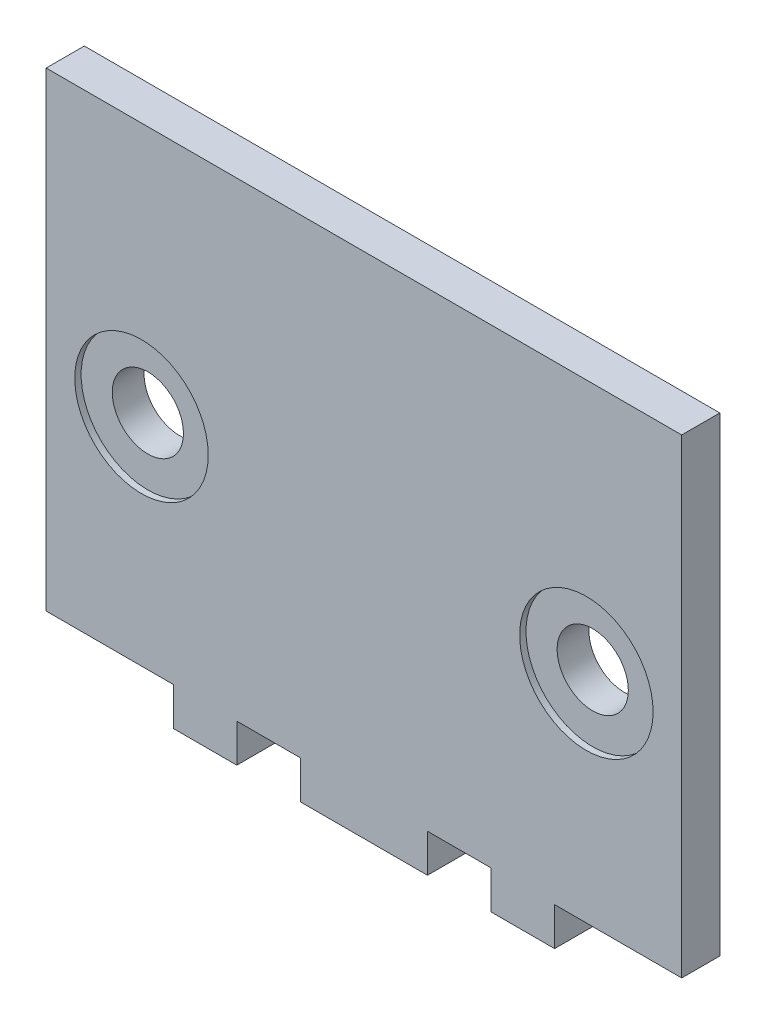
ISO-10303-21;
HEADER;
FILE_DESCRIPTION(('STEP AP214'),'2;1');
FILE_NAME('part.step','',(''),(''),'','','');
FILE_SCHEMA(('AUTOMOTIVE_DESIGN { 1 0 10303 214 1 1 1 1 }'));
ENDSEC;
DATA;
#1=APPLICATION_CONTEXT('core data for automotive mechanical design processes');
#2=APPLICATION_PROTOCOL_DEFINITION('international standard','automotive_design',2000,#1);
#3=PRODUCT_CONTEXT('',#1,'mechanical');
#4=PRODUCT('Part','Part','',(#3));
#5=PRODUCT_RELATED_PRODUCT_CATEGORY('part','',(#4));
#6=PRODUCT_DEFINITION_FORMATION('','',#4);
#7=PRODUCT_DEFINITION_CONTEXT('part definition',#1,'design');
#8=PRODUCT_DEFINITION('design','',#6,#7);
#9=PRODUCT_DEFINITION_SHAPE('','',#8);
#10=(LENGTH_UNIT() NAMED_UNIT(*) SI_UNIT(.MILLI.,.METRE.));
#11=(NAMED_UNIT(*) PLANE_ANGLE_UNIT() SI_UNIT($,.RADIAN.));
#12=(NAMED_UNIT(*) SI_UNIT($,.STERADIAN.) SOLID_ANGLE_UNIT());
#13=UNCERTAINTY_MEASURE_WITH_UNIT(LENGTH_MEASURE(1.E-05),#10,'distance_accuracy_value','');
#14=(GEOMETRIC_REPRESENTATION_CONTEXT(3) GLOBAL_UNCERTAINTY_ASSIGNED_CONTEXT((#13)) GLOBAL_UNIT_ASSIGNED_CONTEXT((#10,
#11,#12)) REPRESENTATION_CONTEXT('',''));
#15=CARTESIAN_POINT('',(0.,0.,0.));
#16=DIRECTION('',(0.,0.,1.));
#17=DIRECTION('',(1.,0.,0.));
#18=AXIS2_PLACEMENT_3D('',#15,#16,#17);
#19=CARTESIAN_POINT('',(0.,20.,3.));
#20=DIRECTION('',(0.,1.,0.));
#21=DIRECTION('',(-1.,0.,0.));
#22=AXIS2_PLACEMENT_3D('',#19,#20,#21);
#23=PLANE('',#22);
#24=DIRECTION('',(1.,0.,0.));
#25=VECTOR('',#24,1.);
#26=CARTESIAN_POINT('',(0.,20.,0.));
#27=LINE('',#26,#25);
#28=CARTESIAN_POINT('',(-25.,20.,0.));
#29=VERTEX_POINT('',#28);
#30=CARTESIAN_POINT('',(25.,20.,0.));
#31=VERTEX_POINT('',#30);
#32=EDGE_CURVE('E168',#29,#31,#27,.T.);
#33=ORIENTED_EDGE('',*,*,#32,.F.);
#34=DIRECTION('',(0.,0.,-1.));
#35=VECTOR('',#34,1.);
#36=CARTESIAN_POINT('',(-25.,20.,3.));
#37=LINE('',#36,#35);
#38=CARTESIAN_POINT('',(-25.,20.,3.));
#39=VERTEX_POINT('',#38);
#40=EDGE_CURVE('E163',#39,#29,#37,.T.);
#41=ORIENTED_EDGE('',*,*,#40,.F.);
#42=DIRECTION('',(1.,0.,0.));
#43=VECTOR('',#42,1.);
#44=CARTESIAN_POINT('',(0.,20.,3.));
#45=LINE('',#44,#43);
#46=CARTESIAN_POINT('',(25.,20.,3.));
#47=VERTEX_POINT('',#46);
#48=EDGE_CURVE('E166',#39,#47,#45,.T.);
#49=ORIENTED_EDGE('',*,*,#48,.T.);
#50=DIRECTION('',(0.,0.,-1.));
#51=VECTOR('',#50,1.);
#52=CARTESIAN_POINT('',(25.,20.,3.));
#53=LINE('',#52,#51);
#54=EDGE_CURVE('E251',#47,#31,#53,.T.);
#55=ORIENTED_EDGE('',*,*,#54,.T.);
#56=EDGE_LOOP('',(#33,#41,#49,#55));
#57=FACE_BOUND('',#56,.T.);
#58=ADVANCED_FACE('F52',(#57),#23,.T.);
#59=CARTESIAN_POINT('',(-25.,0.,3.));
#60=DIRECTION('',(1.,0.,0.));
#61=DIRECTION('',(0.,1.,0.));
#62=AXIS2_PLACEMENT_3D('',#59,#60,#61);
#63=PLANE('',#62);
#64=DIRECTION('',(0.,0.,-1.));
#65=VECTOR('',#64,1.);
#66=CARTESIAN_POINT('',(-25.,-17.,3.));
#67=LINE('',#66,#65);
#68=CARTESIAN_POINT('',(-25.,-17.,3.));
#69=VERTEX_POINT('',#68);
#70=CARTESIAN_POINT('',(-25.,-17.,0.));
#71=VERTEX_POINT('',#70);
#72=EDGE_CURVE('E60',#69,#71,#67,.T.);
#73=ORIENTED_EDGE('',*,*,#72,.F.);
#74=DIRECTION('',(0.,-1.,0.));
#75=VECTOR('',#74,1.);
#76=CARTESIAN_POINT('',(-25.,0.,3.));
#77=LINE('',#76,#75);
#78=EDGE_CURVE('E176',#39,#69,#77,.T.);
#79=ORIENTED_EDGE('',*,*,#78,.F.);
#80=ORIENTED_EDGE('',*,*,#40,.T.);
#81=DIRECTION('',(0.,-1.,0.));
#82=VECTOR('',#81,1.);
#83=CARTESIAN_POINT('',(-25.,0.,0.));
#84=LINE('',#83,#82);
#85=EDGE_CURVE('E254',#29,#71,#84,.T.);
#86=ORIENTED_EDGE('',*,*,#85,.T.);
#87=EDGE_LOOP('',(#73,#79,#80,#86));
#88=FACE_BOUND('',#87,.T.);
#89=ADVANCED_FACE('F177',(#88),#63,.F.);
#90=CARTESIAN_POINT('',(0.,-17.,3.));
#91=DIRECTION('',(0.,1.,0.));
#92=DIRECTION('',(0.,0.,1.));
#93=AXIS2_PLACEMENT_3D('',#90,#91,#92);
#94=PLANE('',#93);
#95=DIRECTION('',(1.,0.,0.));
#96=VECTOR('',#95,1.);
#97=CARTESIAN_POINT('',(0.,-17.,3.));
#98=LINE('',#97,#96);
#99=CARTESIAN_POINT('',(-15.,-17.,3.));
#100=VERTEX_POINT('',#99);
#101=EDGE_CURVE('E181',#69,#100,#98,.T.);
#102=ORIENTED_EDGE('',*,*,#101,.F.);
#103=ORIENTED_EDGE('',*,*,#72,.T.);
#104=DIRECTION('',(1.,0.,0.));
#105=VECTOR('',#104,1.);
#106=CARTESIAN_POINT('',(0.,-17.,0.));
#107=LINE('',#106,#105);
#108=CARTESIAN_POINT('',(-15.,-17.,0.));
#109=VERTEX_POINT('',#108);
#110=EDGE_CURVE('E258',#71,#109,#107,.T.);
#111=ORIENTED_EDGE('',*,*,#110,.T.);
#112=DIRECTION('',(0.,0.,-1.));
#113=VECTOR('',#112,1.);
#114=CARTESIAN_POINT('',(-15.,-17.,3.));
#115=LINE('',#114,#113);
#116=EDGE_CURVE('E173',#100,#109,#115,.T.);
#117=ORIENTED_EDGE('',*,*,#116,.F.);
#118=EDGE_LOOP('',(#102,#103,#111,#117));
#119=FACE_BOUND('',#118,.T.);
#120=ADVANCED_FACE('F350',(#119),#94,.F.);
#121=CARTESIAN_POINT('',(-15.,0.,3.));
#122=DIRECTION('',(1.,0.,0.));
#123=DIRECTION('',(0.,0.,-1.));
#124=AXIS2_PLACEMENT_3D('',#121,#122,#123);
#125=PLANE('',#124);
#126=DIRECTION('',(0.,-1.,0.));
#127=VECTOR('',#126,1.);
#128=CARTESIAN_POINT('',(-15.,0.,0.));
#129=LINE('',#128,#127);
#130=CARTESIAN_POINT('',(-15.,-20.,0.));
#131=VERTEX_POINT('',#130);
#132=EDGE_CURVE('E261',#109,#131,#129,.T.);
#133=ORIENTED_EDGE('',*,*,#132,.T.);
#134=DIRECTION('',(0.,0.,-1.));
#135=VECTOR('',#134,1.);
#136=CARTESIAN_POINT('',(-15.,-20.,3.));
#137=LINE('',#136,#135);
#138=CARTESIAN_POINT('',(-15.,-20.,3.));
#139=VERTEX_POINT('',#138);
#140=EDGE_CURVE('E339',#139,#131,#137,.T.);
#141=ORIENTED_EDGE('',*,*,#140,.F.);
#142=DIRECTION('',(0.,-1.,0.));
#143=VECTOR('',#142,1.);
#144=CARTESIAN_POINT('',(-15.,0.,3.));
#145=LINE('',#144,#143);
#146=EDGE_CURVE('E201',#100,#139,#145,.T.);
#147=ORIENTED_EDGE('',*,*,#146,.F.);
#148=ORIENTED_EDGE('',*,*,#116,.T.);
#149=EDGE_LOOP('',(#133,#141,#147,#148));
#150=FACE_BOUND('',#149,.T.);
#151=ADVANCED_FACE('F360',(#150),#125,.F.);
#152=CARTESIAN_POINT('',(0.,-20.,3.));
#153=DIRECTION('',(0.,1.,0.));
#154=DIRECTION('',(0.,0.,1.));
#155=AXIS2_PLACEMENT_3D('',#152,#153,#154);
#156=PLANE('',#155);
#157=DIRECTION('',(1.,0.,0.));
#158=VECTOR('',#157,1.);
#159=CARTESIAN_POINT('',(0.,-20.,0.));
#160=LINE('',#159,#158);
#161=CARTESIAN_POINT('',(-9.99999999999999,-20.,0.));
#162=VERTEX_POINT('',#161);
#163=EDGE_CURVE('E264',#131,#162,#160,.T.);
#164=ORIENTED_EDGE('',*,*,#163,.T.);
#165=DIRECTION('',(0.,0.,-1.));
#166=VECTOR('',#165,1.);
#167=CARTESIAN_POINT('',(-9.99999999999999,-20.,3.));
#168=LINE('',#167,#166);
#169=CARTESIAN_POINT('',(-9.99999999999999,-20.,3.));
#170=VERTEX_POINT('',#169);
#171=EDGE_CURVE('E336',#170,#162,#168,.T.);
#172=ORIENTED_EDGE('',*,*,#171,.F.);
#173=DIRECTION('',(1.,0.,0.));
#174=VECTOR('',#173,1.);
#175=CARTESIAN_POINT('',(0.,-20.,3.));
#176=LINE('',#175,#174);
#177=EDGE_CURVE('E204',#139,#170,#176,.T.);
#178=ORIENTED_EDGE('',*,*,#177,.F.);
#179=ORIENTED_EDGE('',*,*,#140,.T.);
#180=EDGE_LOOP('',(#164,#172,#178,#179));
#181=FACE_BOUND('',#180,.T.);
#182=ADVANCED_FACE('F364',(#181),#156,.F.);
#183=CARTESIAN_POINT('',(-10.,0.,3.));
#184=DIRECTION('',(1.,0.,0.));
#185=DIRECTION('',(0.,1.,0.));
#186=AXIS2_PLACEMENT_3D('',#183,#184,#185);
#187=PLANE('',#186);
#188=DIRECTION('',(0.,-1.,0.));
#189=VECTOR('',#188,1.);
#190=CARTESIAN_POINT('',(-10.,0.,0.));
#191=LINE('',#190,#189);
#192=CARTESIAN_POINT('',(-9.99999999999999,-17.,0.));
#193=VERTEX_POINT('',#192);
#194=EDGE_CURVE('E268',#193,#162,#191,.T.);
#195=ORIENTED_EDGE('',*,*,#194,.F.);
#196=DIRECTION('',(0.,0.,-1.));
#197=VECTOR('',#196,1.);
#198=CARTESIAN_POINT('',(-9.99999999999999,-17.,3.));
#199=LINE('',#198,#197);
#200=CARTESIAN_POINT('',(-9.99999999999999,-17.,3.));
#201=VERTEX_POINT('',#200);
#202=EDGE_CURVE('E333',#201,#193,#199,.T.);
#203=ORIENTED_EDGE('',*,*,#202,.F.);
#204=DIRECTION('',(0.,-1.,0.));
#205=VECTOR('',#204,1.);
#206=CARTESIAN_POINT('',(-10.,0.,3.));
#207=LINE('',#206,#205);
#208=EDGE_CURVE('E207',#201,#170,#207,.T.);
#209=ORIENTED_EDGE('',*,*,#208,.T.);
#210=ORIENTED_EDGE('',*,*,#171,.T.);
#211=EDGE_LOOP('',(#195,#203,#209,#210));
#212=FACE_BOUND('',#211,.T.);
#213=ADVANCED_FACE('F371',(#212),#187,.T.);
#214=CARTESIAN_POINT('',(0.,-17.,3.));
#215=DIRECTION('',(0.,1.,0.));
#216=DIRECTION('',(-1.,0.,0.));
#217=AXIS2_PLACEMENT_3D('',#214,#215,#216);
#218=PLANE('',#217);
#219=DIRECTION('',(1.,0.,0.));
#220=VECTOR('',#219,1.);
#221=CARTESIAN_POINT('',(0.,-17.,0.));
#222=LINE('',#221,#220);
#223=CARTESIAN_POINT('',(-4.99999999999999,-17.,0.));
#224=VERTEX_POINT('',#223);
#225=EDGE_CURVE('E272',#193,#224,#222,.T.);
#226=ORIENTED_EDGE('',*,*,#225,.T.);
#227=DIRECTION('',(0.,0.,-1.));
#228=VECTOR('',#227,1.);
#229=CARTESIAN_POINT('',(-4.99999999999999,-17.,3.));
#230=LINE('',#229,#228);
#231=CARTESIAN_POINT('',(-4.99999999999999,-17.,3.));
#232=VERTEX_POINT('',#231);
#233=EDGE_CURVE('E329',#232,#224,#230,.T.);
#234=ORIENTED_EDGE('',*,*,#233,.F.);
#235=DIRECTION('',(1.,0.,0.));
#236=VECTOR('',#235,1.);
#237=CARTESIAN_POINT('',(0.,-17.,3.));
#238=LINE('',#237,#236);
#239=EDGE_CURVE('E211',#201,#232,#238,.T.);
#240=ORIENTED_EDGE('',*,*,#239,.F.);
#241=ORIENTED_EDGE('',*,*,#202,.T.);
#242=EDGE_LOOP('',(#226,#234,#240,#241));
#243=FACE_BOUND('',#242,.T.);
#244=ADVANCED_FACE('F374',(#243),#218,.F.);
#245=CARTESIAN_POINT('',(-5.,0.,3.));
#246=DIRECTION('',(1.,0.,0.));
#247=DIRECTION('',(0.,1.,0.));
#248=AXIS2_PLACEMENT_3D('',#245,#246,#247);
#249=PLANE('',#248);
#250=DIRECTION('',(0.,-1.,0.));
#251=VECTOR('',#250,1.);
#252=CARTESIAN_POINT('',(-5.,0.,0.));
#253=LINE('',#252,#251);
#254=CARTESIAN_POINT('',(-4.99999999999999,-20.,0.));
#255=VERTEX_POINT('',#254);
#256=EDGE_CURVE('E275',#224,#255,#253,.T.);
#257=ORIENTED_EDGE('',*,*,#256,.T.);
#258=DIRECTION('',(0.,0.,-1.));
#259=VECTOR('',#258,1.);
#260=CARTESIAN_POINT('',(-4.99999999999999,-20.,3.));
#261=LINE('',#260,#259);
#262=CARTESIAN_POINT('',(-4.99999999999999,-20.,3.));
#263=VERTEX_POINT('',#262);
#264=EDGE_CURVE('E325',#263,#255,#261,.T.);
#265=ORIENTED_EDGE('',*,*,#264,.F.);
#266=DIRECTION('',(0.,-1.,0.));
#267=VECTOR('',#266,1.);
#268=CARTESIAN_POINT('',(-5.,0.,3.));
#269=LINE('',#268,#267);
#270=EDGE_CURVE('E214',#232,#263,#269,.T.);
#271=ORIENTED_EDGE('',*,*,#270,.F.);
#272=ORIENTED_EDGE('',*,*,#233,.T.);
#273=EDGE_LOOP('',(#257,#265,#271,#272));
#274=FACE_BOUND('',#273,.T.);
#275=ADVANCED_FACE('F379',(#274),#249,.F.);
#276=CARTESIAN_POINT('',(0.,-20.,3.));
#277=DIRECTION('',(0.,1.,0.));
#278=DIRECTION('',(0.,0.,1.));
#279=AXIS2_PLACEMENT_3D('',#276,#277,#278);
#280=PLANE('',#279);
#281=DIRECTION('',(1.,0.,0.));
#282=VECTOR('',#281,1.);
#283=CARTESIAN_POINT('',(0.,-20.,0.));
#284=LINE('',#283,#282);
#285=CARTESIAN_POINT('',(5.00000000000001,-20.,0.));
#286=VERTEX_POINT('',#285);
#287=EDGE_CURVE('E278',#255,#286,#284,.T.);
#288=ORIENTED_EDGE('',*,*,#287,.T.);
#289=DIRECTION('',(0.,0.,-1.));
#290=VECTOR('',#289,1.);
#291=CARTESIAN_POINT('',(5.00000000000001,-20.,3.));
#292=LINE('',#291,#290);
#293=CARTESIAN_POINT('',(5.00000000000001,-20.,3.));
#294=VERTEX_POINT('',#293);
#295=EDGE_CURVE('E322',#294,#286,#292,.T.);
#296=ORIENTED_EDGE('',*,*,#295,.F.);
#297=DIRECTION('',(1.,0.,0.));
#298=VECTOR('',#297,1.);
#299=CARTESIAN_POINT('',(0.,-20.,3.));
#300=LINE('',#299,#298);
#301=EDGE_CURVE('E217',#263,#294,#300,.T.);
#302=ORIENTED_EDGE('',*,*,#301,.F.);
#303=ORIENTED_EDGE('',*,*,#264,.T.);
#304=EDGE_LOOP('',(#288,#296,#302,#303));
#305=FACE_BOUND('',#304,.T.);
#306=ADVANCED_FACE('F385',(#305),#280,.F.);
#307=CARTESIAN_POINT('',(5.00000000000001,0.,3.));
#308=DIRECTION('',(1.,0.,0.));
#309=DIRECTION('',(0.,1.,0.));
#310=AXIS2_PLACEMENT_3D('',#307,#308,#309);
#311=PLANE('',#310);
#312=DIRECTION('',(0.,-1.,0.));
#313=VECTOR('',#312,1.);
#314=CARTESIAN_POINT('',(5.00000000000001,0.,0.));
#315=LINE('',#314,#313);
#316=CARTESIAN_POINT('',(5.00000000000001,-17.,0.));
#317=VERTEX_POINT('',#316);
#318=EDGE_CURVE('E282',#317,#286,#315,.T.);
#319=ORIENTED_EDGE('',*,*,#318,.F.);
#320=DIRECTION('',(0.,0.,-1.));
#321=VECTOR('',#320,1.);
#322=CARTESIAN_POINT('',(5.00000000000001,-17.,3.));
#323=LINE('',#322,#321);
#324=CARTESIAN_POINT('',(5.00000000000001,-17.,3.));
#325=VERTEX_POINT('',#324);
#326=EDGE_CURVE('E319',#325,#317,#323,.T.);
#327=ORIENTED_EDGE('',*,*,#326,.F.);
#328=DIRECTION('',(0.,-1.,0.));
#329=VECTOR('',#328,1.);
#330=CARTESIAN_POINT('',(5.00000000000001,0.,3.));
#331=LINE('',#330,#329);
#332=EDGE_CURVE('E220',#325,#294,#331,.T.);
#333=ORIENTED_EDGE('',*,*,#332,.T.);
#334=ORIENTED_EDGE('',*,*,#295,.T.);
#335=EDGE_LOOP('',(#319,#327,#333,#334));
#336=FACE_BOUND('',#335,.T.);
#337=ADVANCED_FACE('F389',(#336),#311,.T.);
#338=CARTESIAN_POINT('',(0.,-17.,3.));
#339=DIRECTION('',(0.,-1.,0.));
#340=DIRECTION('',(0.,0.,-1.));
#341=AXIS2_PLACEMENT_3D('',#338,#339,#340);
#342=PLANE('',#341);
#343=DIRECTION('',(-1.,0.,0.));
#344=VECTOR('',#343,1.);
#345=CARTESIAN_POINT('',(0.,-17.,0.));
#346=LINE('',#345,#344);
#347=CARTESIAN_POINT('',(10.,-17.,0.));
#348=VERTEX_POINT('',#347);
#349=EDGE_CURVE('E286',#348,#317,#346,.T.);
#350=ORIENTED_EDGE('',*,*,#349,.F.);
#351=DIRECTION('',(0.,0.,-1.));
#352=VECTOR('',#351,1.);
#353=CARTESIAN_POINT('',(10.,-17.,3.));
#354=LINE('',#353,#352);
#355=CARTESIAN_POINT('',(10.,-17.,3.));
#356=VERTEX_POINT('',#355);
#357=EDGE_CURVE('E316',#356,#348,#354,.T.);
#358=ORIENTED_EDGE('',*,*,#357,.F.);
#359=DIRECTION('',(-1.,0.,0.));
#360=VECTOR('',#359,1.);
#361=CARTESIAN_POINT('',(0.,-17.,3.));
#362=LINE('',#361,#360);
#363=EDGE_CURVE('E224',#356,#325,#362,.T.);
#364=ORIENTED_EDGE('',*,*,#363,.T.);
#365=ORIENTED_EDGE('',*,*,#326,.T.);
#366=EDGE_LOOP('',(#350,#358,#364,#365));
#367=FACE_BOUND('',#366,.T.);
#368=ADVANCED_FACE('F392',(#367),#342,.T.);
#369=CARTESIAN_POINT('',(10.,0.,3.));
#370=DIRECTION('',(1.,0.,0.));
#371=DIRECTION('',(0.,1.,0.));
#372=AXIS2_PLACEMENT_3D('',#369,#370,#371);
#373=PLANE('',#372);
#374=DIRECTION('',(0.,-1.,0.));
#375=VECTOR('',#374,1.);
#376=CARTESIAN_POINT('',(10.,0.,0.));
#377=LINE('',#376,#375);
#378=CARTESIAN_POINT('',(10.,-20.,0.));
#379=VERTEX_POINT('',#378);
#380=EDGE_CURVE('E290',#348,#379,#377,.T.);
#381=ORIENTED_EDGE('',*,*,#380,.T.);
#382=DIRECTION('',(0.,0.,-1.));
#383=VECTOR('',#382,1.);
#384=CARTESIAN_POINT('',(10.,-20.,3.));
#385=LINE('',#384,#383);
#386=CARTESIAN_POINT('',(10.,-20.,3.));
#387=VERTEX_POINT('',#386);
#388=EDGE_CURVE('E312',#387,#379,#385,.T.);
#389=ORIENTED_EDGE('',*,*,#388,.F.);
#390=DIRECTION('',(0.,-1.,0.));
#391=VECTOR('',#390,1.);
#392=CARTESIAN_POINT('',(10.,0.,3.));
#393=LINE('',#392,#391);
#394=EDGE_CURVE('E228',#356,#387,#393,.T.);
#395=ORIENTED_EDGE('',*,*,#394,.F.);
#396=ORIENTED_EDGE('',*,*,#357,.T.);
#397=EDGE_LOOP('',(#381,#389,#395,#396));
#398=FACE_BOUND('',#397,.T.);
#399=ADVANCED_FACE('F399',(#398),#373,.F.);
#400=CARTESIAN_POINT('',(0.,-20.,3.));
#401=DIRECTION('',(0.,1.,0.));
#402=DIRECTION('',(0.,0.,1.));
#403=AXIS2_PLACEMENT_3D('',#400,#401,#402);
#404=PLANE('',#403);
#405=DIRECTION('',(1.,0.,0.));
#406=VECTOR('',#405,1.);
#407=CARTESIAN_POINT('',(0.,-20.,0.));
#408=LINE('',#407,#406);
#409=CARTESIAN_POINT('',(15.,-20.,0.));
#410=VERTEX_POINT('',#409);
#411=EDGE_CURVE('E293',#379,#410,#408,.T.);
#412=ORIENTED_EDGE('',*,*,#411,.T.);
#413=DIRECTION('',(0.,0.,-1.));
#414=VECTOR('',#413,1.);
#415=CARTESIAN_POINT('',(15.,-20.,3.));
#416=LINE('',#415,#414);
#417=CARTESIAN_POINT('',(15.,-20.,3.));
#418=VERTEX_POINT('',#417);
#419=EDGE_CURVE('E309',#418,#410,#416,.T.);
#420=ORIENTED_EDGE('',*,*,#419,.F.);
#421=DIRECTION('',(1.,0.,0.));
#422=VECTOR('',#421,1.);
#423=CARTESIAN_POINT('',(0.,-20.,3.));
#424=LINE('',#423,#422);
#425=EDGE_CURVE('E231',#387,#418,#424,.T.);
#426=ORIENTED_EDGE('',*,*,#425,.F.);
#427=ORIENTED_EDGE('',*,*,#388,.T.);
#428=EDGE_LOOP('',(#412,#420,#426,#427));
#429=FACE_BOUND('',#428,.T.);
#430=ADVANCED_FACE('F403',(#429),#404,.F.);
#431=CARTESIAN_POINT('',(15.,0.,3.));
#432=DIRECTION('',(1.,0.,0.));
#433=DIRECTION('',(0.,0.,-1.));
#434=AXIS2_PLACEMENT_3D('',#431,#432,#433);
#435=PLANE('',#434);
#436=DIRECTION('',(0.,-1.,0.));
#437=VECTOR('',#436,1.);
#438=CARTESIAN_POINT('',(15.,0.,0.));
#439=LINE('',#438,#437);
#440=CARTESIAN_POINT('',(15.,-17.,0.));
#441=VERTEX_POINT('',#440);
#442=EDGE_CURVE('E297',#441,#410,#439,.T.);
#443=ORIENTED_EDGE('',*,*,#442,.F.);
#444=DIRECTION('',(0.,0.,-1.));
#445=VECTOR('',#444,1.);
#446=CARTESIAN_POINT('',(15.,-17.,3.));
#447=LINE('',#446,#445);
#448=CARTESIAN_POINT('',(15.,-17.,3.));
#449=VERTEX_POINT('',#448);
#450=EDGE_CURVE('E305',#449,#441,#447,.T.);
#451=ORIENTED_EDGE('',*,*,#450,.F.);
#452=DIRECTION('',(0.,-1.,0.));
#453=VECTOR('',#452,1.);
#454=CARTESIAN_POINT('',(15.,0.,3.));
#455=LINE('',#454,#453);
#456=EDGE_CURVE('E234',#449,#418,#455,.T.);
#457=ORIENTED_EDGE('',*,*,#456,.T.);
#458=ORIENTED_EDGE('',*,*,#419,.T.);
#459=EDGE_LOOP('',(#443,#451,#457,#458));
#460=FACE_BOUND('',#459,.T.);
#461=ADVANCED_FACE('F406',(#460),#435,.T.);
#462=CARTESIAN_POINT('',(0.,-17.,3.));
#463=DIRECTION('',(0.,-1.,0.));
#464=DIRECTION('',(0.,0.,-1.));
#465=AXIS2_PLACEMENT_3D('',#462,#463,#464);
#466=PLANE('',#465);
#467=DIRECTION('',(0.,0.,-1.));
#468=VECTOR('',#467,1.);
#469=CARTESIAN_POINT('',(25.,-17.,3.));
#470=LINE('',#469,#468);
#471=CARTESIAN_POINT('',(25.,-17.,3.));
#472=VERTEX_POINT('',#471);
#473=CARTESIAN_POINT('',(25.,-17.,0.));
#474=VERTEX_POINT('',#473);
#475=EDGE_CURVE('E12',#472,#474,#470,.T.);
#476=ORIENTED_EDGE('',*,*,#475,.F.);
#477=DIRECTION('',(-1.,0.,0.));
#478=VECTOR('',#477,1.);
#479=CARTESIAN_POINT('',(0.,-17.,3.));
#480=LINE('',#479,#478);
#481=EDGE_CURVE('E238',#472,#449,#480,.T.);
#482=ORIENTED_EDGE('',*,*,#481,.T.);
#483=ORIENTED_EDGE('',*,*,#450,.T.);
#484=DIRECTION('',(-1.,0.,0.));
#485=VECTOR('',#484,1.);
#486=CARTESIAN_POINT('',(0.,-17.,0.));
#487=LINE('',#486,#485);
#488=EDGE_CURVE('E193',#474,#441,#487,.T.);
#489=ORIENTED_EDGE('',*,*,#488,.F.);
#490=EDGE_LOOP('',(#476,#482,#483,#489));
#491=FACE_BOUND('',#490,.T.);
#492=ADVANCED_FACE('F407',(#491),#466,.T.);
#493=CARTESIAN_POINT('',(-17.5,0.,3.));
#494=DIRECTION('',(0.,0.,-1.));
#495=DIRECTION('',(-1.,0.,0.));
#496=AXIS2_PLACEMENT_3D('',#493,#494,#495);
#497=CYLINDRICAL_SURFACE('',#496,5.25);
#498=CARTESIAN_POINT('',(-17.5,0.,2.5));
#499=DIRECTION('',(0.,0.,1.));
#500=DIRECTION('',(1.,0.,0.));
#501=AXIS2_PLACEMENT_3D('',#498,#499,#500);
#502=CIRCLE('',#501,5.25);
#503=CARTESIAN_POINT('',(-12.25,0.,2.5));
#504=VERTEX_POINT('',#503);
#505=EDGE_CURVE('E172',#504,#504,#502,.T.);
#506=ORIENTED_EDGE('',*,*,#505,.F.);
#507=EDGE_LOOP('',(#506));
#508=FACE_BOUND('',#507,.T.);
#509=CARTESIAN_POINT('',(-17.5,0.,3.));
#510=DIRECTION('',(0.,0.,1.));
#511=DIRECTION('',(1.,0.,0.));
#512=AXIS2_PLACEMENT_3D('',#509,#510,#511);
#513=CIRCLE('',#512,5.25);
#514=CARTESIAN_POINT('',(-12.25,0.,3.));
#515=VERTEX_POINT('',#514);
#516=EDGE_CURVE('E243',#515,#515,#513,.T.);
#517=ORIENTED_EDGE('',*,*,#516,.T.);
#518=EDGE_LOOP('',(#517));
#519=FACE_BOUND('',#518,.T.);
#520=ADVANCED_FACE('F411',(#508,#519),#497,.F.);
#521=CARTESIAN_POINT('',(25.,0.,3.));
#522=DIRECTION('',(1.,0.,0.));
#523=DIRECTION('',(0.,0.,-1.));
#524=AXIS2_PLACEMENT_3D('',#521,#522,#523);
#525=PLANE('',#524);
#526=DIRECTION('',(0.,-1.,0.));
#527=VECTOR('',#526,1.);
#528=CARTESIAN_POINT('',(25.,0.,3.));
#529=LINE('',#528,#527);
#530=EDGE_CURVE('E186',#47,#472,#529,.T.);
#531=ORIENTED_EDGE('',*,*,#530,.T.);
#532=ORIENTED_EDGE('',*,*,#475,.T.);
#533=DIRECTION('',(0.,-1.,0.));
#534=VECTOR('',#533,1.);
#535=CARTESIAN_POINT('',(25.,0.,0.));
#536=LINE('',#535,#534);
#537=EDGE_CURVE('E189',#31,#474,#536,.T.);
#538=ORIENTED_EDGE('',*,*,#537,.F.);
#539=ORIENTED_EDGE('',*,*,#54,.F.);
#540=EDGE_LOOP('',(#531,#532,#538,#539));
#541=FACE_BOUND('',#540,.T.);
#542=ADVANCED_FACE('F408',(#541),#525,.T.);
#543=CARTESIAN_POINT('',(17.5,0.,3.));
#544=DIRECTION('',(0.,0.,-1.));
#545=DIRECTION('',(-1.,0.,0.));
#546=AXIS2_PLACEMENT_3D('',#543,#544,#545);
#547=CYLINDRICAL_SURFACE('',#546,5.25);
#548=CARTESIAN_POINT('',(17.5,0.,2.5));
#549=DIRECTION('',(0.,0.,1.));
#550=DIRECTION('',(1.,0.,0.));
#551=AXIS2_PLACEMENT_3D('',#548,#549,#550);
#552=CIRCLE('',#551,5.25);
#553=CARTESIAN_POINT('',(22.75,0.,2.5));
#554=VERTEX_POINT('',#553);
#555=EDGE_CURVE('E639',#554,#554,#552,.F.);
#556=ORIENTED_EDGE('',*,*,#555,.T.);
#557=EDGE_LOOP('',(#556));
#558=FACE_BOUND('',#557,.T.);
#559=CARTESIAN_POINT('',(17.5,0.,3.));
#560=DIRECTION('',(0.,0.,1.));
#561=DIRECTION('',(1.,0.,0.));
#562=AXIS2_PLACEMENT_3D('',#559,#560,#561);
#563=CIRCLE('',#562,5.25);
#564=CARTESIAN_POINT('',(22.75,0.,3.));
#565=VERTEX_POINT('',#564);
#566=EDGE_CURVE('E247',#565,#565,#563,.F.);
#567=ORIENTED_EDGE('',*,*,#566,.F.);
#568=EDGE_LOOP('',(#567));
#569=FACE_BOUND('',#568,.T.);
#570=ADVANCED_FACE('F410',(#558,#569),#547,.F.);
#571=CARTESIAN_POINT('',(0.,0.,3.));
#572=DIRECTION('',(0.,0.,1.));
#573=DIRECTION('',(1.,0.,0.));
#574=AXIS2_PLACEMENT_3D('',#571,#572,#573);
#575=PLANE('',#574);
#576=ORIENTED_EDGE('',*,*,#48,.F.);
#577=ORIENTED_EDGE('',*,*,#78,.T.);
#578=ORIENTED_EDGE('',*,*,#101,.T.);
#579=ORIENTED_EDGE('',*,*,#146,.T.);
#580=ORIENTED_EDGE('',*,*,#177,.T.);
#581=ORIENTED_EDGE('',*,*,#208,.F.);
#582=ORIENTED_EDGE('',*,*,#239,.T.);
#583=ORIENTED_EDGE('',*,*,#270,.T.);
#584=ORIENTED_EDGE('',*,*,#301,.T.);
#585=ORIENTED_EDGE('',*,*,#332,.F.);
#586=ORIENTED_EDGE('',*,*,#363,.F.);
#587=ORIENTED_EDGE('',*,*,#394,.T.);
#588=ORIENTED_EDGE('',*,*,#425,.T.);
#589=ORIENTED_EDGE('',*,*,#456,.F.);
#590=ORIENTED_EDGE('',*,*,#481,.F.);
#591=ORIENTED_EDGE('',*,*,#530,.F.);
#592=EDGE_LOOP('',(#576,#577,#578,#579,#580,#581,#582,#583,#584,#585,#586,#587,#588,#589,#590,#591));
#593=FACE_BOUND('',#592,.T.);
#594=ORIENTED_EDGE('',*,*,#516,.F.);
#595=EDGE_LOOP('',(#594));
#596=FACE_BOUND('',#595,.T.);
#597=ORIENTED_EDGE('',*,*,#566,.T.);
#598=EDGE_LOOP('',(#597));
#599=FACE_BOUND('',#598,.T.);
#600=ADVANCED_FACE('F183',(#593,#596,#599),#575,.T.);
#601=CARTESIAN_POINT('',(0.,0.,0.));
#602=DIRECTION('',(0.,0.,1.));
#603=DIRECTION('',(1.,0.,0.));
#604=AXIS2_PLACEMENT_3D('',#601,#602,#603);
#605=PLANE('',#604);
#606=ORIENTED_EDGE('',*,*,#32,.T.);
#607=ORIENTED_EDGE('',*,*,#537,.T.);
#608=ORIENTED_EDGE('',*,*,#488,.T.);
#609=ORIENTED_EDGE('',*,*,#442,.T.);
#610=ORIENTED_EDGE('',*,*,#411,.F.);
#611=ORIENTED_EDGE('',*,*,#380,.F.);
#612=ORIENTED_EDGE('',*,*,#349,.T.);
#613=ORIENTED_EDGE('',*,*,#318,.T.);
#614=ORIENTED_EDGE('',*,*,#287,.F.);
#615=ORIENTED_EDGE('',*,*,#256,.F.);
#616=ORIENTED_EDGE('',*,*,#225,.F.);
#617=ORIENTED_EDGE('',*,*,#194,.T.);
#618=ORIENTED_EDGE('',*,*,#163,.F.);
#619=ORIENTED_EDGE('',*,*,#132,.F.);
#620=ORIENTED_EDGE('',*,*,#110,.F.);
#621=ORIENTED_EDGE('',*,*,#85,.F.);
#622=EDGE_LOOP('',(#606,#607,#608,#609,#610,#611,#612,#613,#614,#615,#616,#617,#618,#619,#620,#621));
#623=FACE_BOUND('',#622,.T.);
#624=CARTESIAN_POINT('',(17.5,0.,0.));
#625=DIRECTION('',(0.,0.,1.));
#626=DIRECTION('',(1.,0.,0.));
#627=AXIS2_PLACEMENT_3D('',#624,#625,#626);
#628=CIRCLE('',#627,2.8);
#629=CARTESIAN_POINT('',(20.3,0.,0.));
#630=VERTEX_POINT('',#629);
#631=EDGE_CURVE('E634',#630,#630,#628,.F.);
#632=ORIENTED_EDGE('',*,*,#631,.F.);
#633=EDGE_LOOP('',(#632));
#634=FACE_BOUND('',#633,.T.);
#635=CARTESIAN_POINT('',(-17.5,0.,0.));
#636=DIRECTION('',(0.,0.,1.));
#637=DIRECTION('',(1.,0.,0.));
#638=AXIS2_PLACEMENT_3D('',#635,#636,#637);
#639=CIRCLE('',#638,2.8);
#640=CARTESIAN_POINT('',(-14.7,0.,0.));
#641=VERTEX_POINT('',#640);
#642=EDGE_CURVE('E635',#641,#641,#639,.T.);
#643=ORIENTED_EDGE('',*,*,#642,.T.);
#644=EDGE_LOOP('',(#643));
#645=FACE_BOUND('',#644,.T.);
#646=ADVANCED_FACE('F355',(#623,#634,#645),#605,.F.);
#647=CARTESIAN_POINT('',(17.5,0.,3.));
#648=DIRECTION('',(0.,0.,-1.));
#649=DIRECTION('',(-1.,0.,0.));
#650=AXIS2_PLACEMENT_3D('',#647,#648,#649);
#651=CYLINDRICAL_SURFACE('',#650,2.8);
#652=CARTESIAN_POINT('',(17.5,0.,2.5));
#653=DIRECTION('',(0.,0.,1.));
#654=DIRECTION('',(1.,0.,0.));
#655=AXIS2_PLACEMENT_3D('',#652,#653,#654);
#656=CIRCLE('',#655,2.8);
#657=CARTESIAN_POINT('',(20.3,0.,2.5));
#658=VERTEX_POINT('',#657);
#659=EDGE_CURVE('E255',#658,#658,#656,.F.);
#660=ORIENTED_EDGE('',*,*,#659,.F.);
#661=EDGE_LOOP('',(#660));
#662=FACE_BOUND('',#661,.T.);
#663=ORIENTED_EDGE('',*,*,#631,.T.);
#664=EDGE_LOOP('',(#663));
#665=FACE_BOUND('',#664,.T.);
#666=ADVANCED_FACE('F539',(#662,#665),#651,.F.);
#667=CARTESIAN_POINT('',(0.,0.,2.5));
#668=DIRECTION('',(0.,0.,1.));
#669=DIRECTION('',(1.,0.,0.));
#670=AXIS2_PLACEMENT_3D('',#667,#668,#669);
#671=PLANE('',#670);
#672=ORIENTED_EDGE('',*,*,#555,.F.);
#673=EDGE_LOOP('',(#672));
#674=FACE_BOUND('',#673,.T.);
#675=ORIENTED_EDGE('',*,*,#659,.T.);
#676=EDGE_LOOP('',(#675));
#677=FACE_BOUND('',#676,.T.);
#678=ADVANCED_FACE('F548',(#674,#677),#671,.T.);
#679=CARTESIAN_POINT('',(-17.5,0.,3.));
#680=DIRECTION('',(0.,0.,-1.));
#681=DIRECTION('',(-1.,0.,0.));
#682=AXIS2_PLACEMENT_3D('',#679,#680,#681);
#683=CYLINDRICAL_SURFACE('',#682,2.8);
#684=CARTESIAN_POINT('',(-17.5,0.,2.5));
#685=DIRECTION('',(0.,0.,1.));
#686=DIRECTION('',(1.,0.,0.));
#687=AXIS2_PLACEMENT_3D('',#684,#685,#686);
#688=CIRCLE('',#687,2.8);
#689=CARTESIAN_POINT('',(-14.7,0.,2.5));
#690=VERTEX_POINT('',#689);
#691=EDGE_CURVE('E196',#690,#690,#688,.T.);
#692=ORIENTED_EDGE('',*,*,#691,.T.);
#693=EDGE_LOOP('',(#692));
#694=FACE_BOUND('',#693,.T.);
#695=ORIENTED_EDGE('',*,*,#642,.F.);
#696=EDGE_LOOP('',(#695));
#697=FACE_BOUND('',#696,.T.);
#698=ADVANCED_FACE('F558',(#694,#697),#683,.F.);
#699=CARTESIAN_POINT('',(0.,0.,2.5));
#700=DIRECTION('',(0.,0.,1.));
#701=DIRECTION('',(1.,0.,0.));
#702=AXIS2_PLACEMENT_3D('',#699,#700,#701);
#703=PLANE('',#702);
#704=ORIENTED_EDGE('',*,*,#691,.F.);
#705=EDGE_LOOP('',(#704));
#706=FACE_BOUND('',#705,.T.);
#707=ORIENTED_EDGE('',*,*,#505,.T.);
#708=EDGE_LOOP('',(#707));
#709=FACE_BOUND('',#708,.T.);
#710=ADVANCED_FACE('F568',(#706,#709),#703,.T.);
#711=CLOSED_SHELL('',(#58,#89,#120,#151,#182,#213,#244,#275,#306,#337,#368,#399,#430,#461,#492,
#520,#542,#570,#600,#646,#666,#678,#698,#710));
#712=MANIFOLD_SOLID_BREP('B2',#711);
#713=ADVANCED_BREP_SHAPE_REPRESENTATION('',(#18,#712),#14);
#714=SHAPE_DEFINITION_REPRESENTATION(#9,#713);
ENDSEC;
END-ISO-10303-21;
